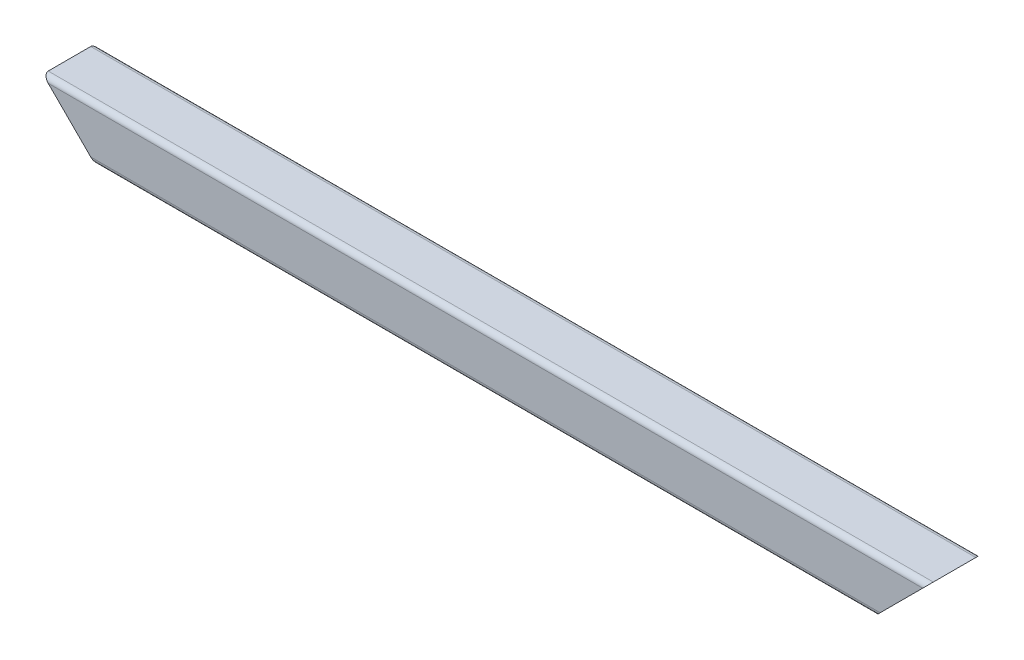
ISO-10303-21;
HEADER;
FILE_DESCRIPTION(('STEP AP214'),'2;1');
FILE_NAME('part.step','',(''),(''),'','','');
FILE_SCHEMA(('AUTOMOTIVE_DESIGN { 1 0 10303 214 1 1 1 1 }'));
ENDSEC;
DATA;
#1=APPLICATION_CONTEXT('core data for automotive mechanical design processes');
#2=APPLICATION_PROTOCOL_DEFINITION('international standard','automotive_design',2000,#1);
#3=PRODUCT_CONTEXT('',#1,'mechanical');
#4=PRODUCT('Part','Part','',(#3));
#5=PRODUCT_RELATED_PRODUCT_CATEGORY('part','',(#4));
#6=PRODUCT_DEFINITION_FORMATION('','',#4);
#7=PRODUCT_DEFINITION_CONTEXT('part definition',#1,'design');
#8=PRODUCT_DEFINITION('design','',#6,#7);
#9=PRODUCT_DEFINITION_SHAPE('','',#8);
#10=(LENGTH_UNIT() NAMED_UNIT(*) SI_UNIT(.MILLI.,.METRE.));
#11=(NAMED_UNIT(*) PLANE_ANGLE_UNIT() SI_UNIT($,.RADIAN.));
#12=(NAMED_UNIT(*) SI_UNIT($,.STERADIAN.) SOLID_ANGLE_UNIT());
#13=UNCERTAINTY_MEASURE_WITH_UNIT(LENGTH_MEASURE(1.E-05),#10,'distance_accuracy_value','');
#14=(GEOMETRIC_REPRESENTATION_CONTEXT(3) GLOBAL_UNCERTAINTY_ASSIGNED_CONTEXT((#13)) GLOBAL_UNIT_ASSIGNED_CONTEXT((#10,
#11,#12)) REPRESENTATION_CONTEXT('',''));
#15=CARTESIAN_POINT('',(0.,0.,0.));
#16=DIRECTION('',(0.,0.,1.));
#17=DIRECTION('',(1.,0.,0.));
#18=AXIS2_PLACEMENT_3D('',#15,#16,#17);
#19=CARTESIAN_POINT('',(125.,893.,-72.4999999999944));
#20=DIRECTION('',(-1.,0.,0.));
#21=DIRECTION('',(0.,0.,1.));
#22=AXIS2_PLACEMENT_3D('',#19,#20,#21);
#23=CYLINDRICAL_SURFACE('',#22,3.);
#24=CARTESIAN_POINT('',(223.,893.,-72.4999999999863));
#25=DIRECTION('',(0.707106781186547,-0.707106781186548,0.));
#26=DIRECTION('',(-0.707106781186548,-0.707106781186547,0.));
#27=AXIS2_PLACEMENT_3D('',#24,#25,#26);
#28=ELLIPSE('',#27,4.24264068711929,3.);
#29=CARTESIAN_POINT('',(223.,893.,-69.4999999999858));
#30=VERTEX_POINT('',#29);
#31=CARTESIAN_POINT('',(220.,890.,-72.4999999999865));
#32=VERTEX_POINT('',#31);
#33=EDGE_CURVE('E20',#30,#32,#28,.T.);
#34=ORIENTED_EDGE('',*,*,#33,.F.);
#35=DIRECTION('',(1.,0.,0.));
#36=VECTOR('',#35,1.);
#37=CARTESIAN_POINT('',(1.05345683867447E-13,893.,-69.5000000000048));
#38=LINE('',#37,#36);
#39=CARTESIAN_POINT('',(-222.999999999999,893.,-69.5000000000232));
#40=VERTEX_POINT('',#39);
#41=EDGE_CURVE('E111',#40,#30,#38,.T.);
#42=ORIENTED_EDGE('',*,*,#41,.F.);
#43=CARTESIAN_POINT('',(-222.999999999999,893.,-72.5000000000232));
#44=DIRECTION('',(-0.707106781186547,-0.707106781186548,0.));
#45=DIRECTION('',(-0.707106781186548,0.707106781186547,0.));
#46=AXIS2_PLACEMENT_3D('',#43,#44,#45);
#47=ELLIPSE('',#46,4.24264068711929,3.);
#48=CARTESIAN_POINT('',(-219.999999999998,890.,-72.5000000000048));
#49=VERTEX_POINT('',#48);
#50=EDGE_CURVE('E82',#49,#40,#47,.T.);
#51=ORIENTED_EDGE('',*,*,#50,.F.);
#52=DIRECTION('',(1.,0.,0.));
#53=VECTOR('',#52,1.);
#54=CARTESIAN_POINT('',(250.,890.,-72.4999999999865));
#55=LINE('',#54,#53);
#56=EDGE_CURVE('E79',#32,#49,#55,.F.);
#57=ORIENTED_EDGE('',*,*,#56,.F.);
#58=EDGE_LOOP('',(#34,#42,#51,#57));
#59=FACE_BOUND('',#58,.T.);
#60=ADVANCED_FACE('F17',(#59),#23,.T.);
#61=CARTESIAN_POINT('',(1.05345683867447E-13,440.,-69.5000000000048));
#62=DIRECTION('',(0.,0.,1.));
#63=DIRECTION('',(1.,0.,0.));
#64=AXIS2_PLACEMENT_3D('',#61,#62,#63);
#65=PLANE('',#64);
#66=DIRECTION('',(-1.,0.,0.));
#67=VECTOR('',#66,1.);
#68=CARTESIAN_POINT('',(-139.999999999999,917.,-69.5000000000163));
#69=LINE('',#68,#67);
#70=CARTESIAN_POINT('',(-246.999999999999,917.,-69.5000000000247));
#71=VERTEX_POINT('',#70);
#72=CARTESIAN_POINT('',(247.,917.,-69.4999999999843));
#73=VERTEX_POINT('',#72);
#74=EDGE_CURVE('E103',#71,#73,#69,.F.);
#75=ORIENTED_EDGE('',*,*,#74,.F.);
#76=DIRECTION('',(0.707106781186548,-0.707106781186547,0.));
#77=VECTOR('',#76,1.);
#78=CARTESIAN_POINT('',(-219.999999999999,890.,-69.5000000000232));
#79=LINE('',#78,#77);
#80=EDGE_CURVE('E122',#40,#71,#79,.F.);
#81=ORIENTED_EDGE('',*,*,#80,.F.);
#82=ORIENTED_EDGE('',*,*,#41,.T.);
#83=DIRECTION('',(0.707106781186548,0.707106781186547,0.));
#84=VECTOR('',#83,1.);
#85=CARTESIAN_POINT('',(250.,920.,-69.4999999999843));
#86=LINE('',#85,#84);
#87=EDGE_CURVE('E102',#73,#30,#86,.F.);
#88=ORIENTED_EDGE('',*,*,#87,.F.);
#89=EDGE_LOOP('',(#75,#81,#82,#88));
#90=FACE_BOUND('',#89,.T.);
#91=ADVANCED_FACE('F163',(#90),#65,.T.);
#92=CARTESIAN_POINT('',(2.57682764015499E-12,440.,-99.5000000000048));
#93=DIRECTION('',(0.,0.,-1.));
#94=DIRECTION('',(-1.,0.,0.));
#95=AXIS2_PLACEMENT_3D('',#92,#93,#94);
#96=PLANE('',#95);
#97=DIRECTION('',(-1.,0.,0.));
#98=VECTOR('',#97,1.);
#99=CARTESIAN_POINT('',(125.000000000002,893.,-99.4999999999944));
#100=LINE('',#99,#98);
#101=CARTESIAN_POINT('',(-222.999999999997,893.,-99.5000000000237));
#102=VERTEX_POINT('',#101);
#103=CARTESIAN_POINT('',(223.000000000002,893.,-99.4999999999863));
#104=VERTEX_POINT('',#103);
#105=EDGE_CURVE('E87',#102,#104,#100,.F.);
#106=ORIENTED_EDGE('',*,*,#105,.F.);
#107=DIRECTION('',(0.707106781186548,-0.707106781186547,0.));
#108=VECTOR('',#107,1.);
#109=CARTESIAN_POINT('',(-219.999999999998,890.000000000001,-99.5000000000252));
#110=LINE('',#109,#108);
#111=CARTESIAN_POINT('',(-246.999999999997,917.,-99.5000000000253));
#112=VERTEX_POINT('',#111);
#113=EDGE_CURVE('E117',#112,#102,#110,.T.);
#114=ORIENTED_EDGE('',*,*,#113,.F.);
#115=DIRECTION('',(1.,0.,0.));
#116=VECTOR('',#115,1.);
#117=CARTESIAN_POINT('',(-139.999999999997,917.,-99.5000000000164));
#118=LINE('',#117,#116);
#119=CARTESIAN_POINT('',(247.000000000002,917.,-99.4999999999848));
#120=VERTEX_POINT('',#119);
#121=EDGE_CURVE('E124',#120,#112,#118,.F.);
#122=ORIENTED_EDGE('',*,*,#121,.F.);
#123=DIRECTION('',(0.707106781186548,0.707106781186547,0.));
#124=VECTOR('',#123,1.);
#125=CARTESIAN_POINT('',(250.000000000001,919.999999999999,-99.4999999999863));
#126=LINE('',#125,#124);
#127=EDGE_CURVE('E129',#104,#120,#126,.T.);
#128=ORIENTED_EDGE('',*,*,#127,.F.);
#129=EDGE_LOOP('',(#106,#114,#122,#128));
#130=FACE_BOUND('',#129,.T.);
#131=ADVANCED_FACE('F154',(#130),#96,.T.);
#132=CARTESIAN_POINT('',(125.000000000002,893.,-96.4999999999944));
#133=DIRECTION('',(-1.,0.,0.));
#134=DIRECTION('',(0.,0.,1.));
#135=AXIS2_PLACEMENT_3D('',#132,#133,#134);
#136=CYLINDRICAL_SURFACE('',#135,3.);
#137=CARTESIAN_POINT('',(223.000000000002,893.,-96.4999999999863));
#138=DIRECTION('',(0.707106781186547,-0.707106781186548,0.));
#139=DIRECTION('',(-0.707106781186548,-0.707106781186547,0.));
#140=AXIS2_PLACEMENT_3D('',#137,#138,#139);
#141=ELLIPSE('',#140,4.24264068711928,3.);
#142=CARTESIAN_POINT('',(220.000000000002,890.,-96.5000000000047));
#143=VERTEX_POINT('',#142);
#144=EDGE_CURVE('E96',#143,#104,#141,.T.);
#145=ORIENTED_EDGE('',*,*,#144,.F.);
#146=DIRECTION('',(1.,0.,0.));
#147=VECTOR('',#146,1.);
#148=CARTESIAN_POINT('',(250.,890.,-96.500000000023));
#149=LINE('',#148,#147);
#150=CARTESIAN_POINT('',(-219.999999999997,890.,-96.500000000023));
#151=VERTEX_POINT('',#150);
#152=EDGE_CURVE('E86',#151,#143,#149,.T.);
#153=ORIENTED_EDGE('',*,*,#152,.F.);
#154=CARTESIAN_POINT('',(-222.999999999997,893.,-96.5000000000233));
#155=DIRECTION('',(-0.707106781186547,-0.707106781186548,0.));
#156=DIRECTION('',(-0.707106781186548,0.707106781186547,0.));
#157=AXIS2_PLACEMENT_3D('',#154,#155,#156);
#158=ELLIPSE('',#157,4.24264068711928,3.);
#159=EDGE_CURVE('E113',#102,#151,#158,.T.);
#160=ORIENTED_EDGE('',*,*,#159,.F.);
#161=ORIENTED_EDGE('',*,*,#105,.T.);
#162=EDGE_LOOP('',(#145,#153,#160,#161));
#163=FACE_BOUND('',#162,.T.);
#164=ADVANCED_FACE('F155',(#163),#136,.T.);
#165=CARTESIAN_POINT('',(250.,890.,-69.4999999999841));
#166=DIRECTION('',(0.,-1.,0.));
#167=DIRECTION('',(0.,0.,-1.));
#168=AXIS2_PLACEMENT_3D('',#165,#166,#167);
#169=PLANE('',#168);
#170=ORIENTED_EDGE('',*,*,#152,.T.);
#171=DIRECTION('',(0.,0.,1.));
#172=VECTOR('',#171,1.);
#173=CARTESIAN_POINT('',(220.,890.,-69.4999999999841));
#174=LINE('',#173,#172);
#175=EDGE_CURVE('E90',#32,#143,#174,.F.);
#176=ORIENTED_EDGE('',*,*,#175,.F.);
#177=ORIENTED_EDGE('',*,*,#56,.T.);
#178=DIRECTION('',(0.,0.,1.));
#179=VECTOR('',#178,1.);
#180=CARTESIAN_POINT('',(-219.999999999998,889.999999999999,-69.500000000023));
#181=LINE('',#180,#179);
#182=EDGE_CURVE('E116',#151,#49,#181,.T.);
#183=ORIENTED_EDGE('',*,*,#182,.F.);
#184=EDGE_LOOP('',(#170,#176,#177,#183));
#185=FACE_BOUND('',#184,.T.);
#186=ADVANCED_FACE('F91',(#185),#169,.T.);
#187=CARTESIAN_POINT('',(-139.999999999999,917.,-72.5000000000163));
#188=DIRECTION('',(-1.,0.,0.));
#189=DIRECTION('',(0.,0.,1.));
#190=AXIS2_PLACEMENT_3D('',#187,#188,#189);
#191=CYLINDRICAL_SURFACE('',#190,3.);
#192=CARTESIAN_POINT('',(247.,917.,-72.4999999999843));
#193=DIRECTION('',(0.707106781186547,-0.707106781186548,0.));
#194=DIRECTION('',(-0.707106781186548,-0.707106781186547,0.));
#195=AXIS2_PLACEMENT_3D('',#192,#193,#194);
#196=ELLIPSE('',#195,4.24264068711929,3.);
#197=CARTESIAN_POINT('',(250.,920.,-72.5000000000048));
#198=VERTEX_POINT('',#197);
#199=EDGE_CURVE('E128',#198,#73,#196,.T.);
#200=ORIENTED_EDGE('',*,*,#199,.F.);
#201=DIRECTION('',(1.,0.,0.));
#202=VECTOR('',#201,1.);
#203=CARTESIAN_POINT('',(-279.999999999999,920.,-72.5000000000254));
#204=LINE('',#203,#202);
#205=CARTESIAN_POINT('',(-249.999999999998,920.,-72.5000000000254));
#206=VERTEX_POINT('',#205);
#207=EDGE_CURVE('E137',#206,#198,#204,.T.);
#208=ORIENTED_EDGE('',*,*,#207,.F.);
#209=CARTESIAN_POINT('',(-246.999999999999,917.,-72.5000000000252));
#210=DIRECTION('',(-0.707106781186547,-0.707106781186548,0.));
#211=DIRECTION('',(-0.707106781186548,0.707106781186547,0.));
#212=AXIS2_PLACEMENT_3D('',#209,#210,#211);
#213=ELLIPSE('',#212,4.24264068711929,3.);
#214=EDGE_CURVE('E119',#71,#206,#213,.T.);
#215=ORIENTED_EDGE('',*,*,#214,.F.);
#216=ORIENTED_EDGE('',*,*,#74,.T.);
#217=EDGE_LOOP('',(#200,#208,#215,#216));
#218=FACE_BOUND('',#217,.T.);
#219=ADVANCED_FACE('F160',(#218),#191,.T.);
#220=CARTESIAN_POINT('',(250.,920.,-69.4999999999841));
#221=DIRECTION('',(0.707106781186547,-0.707106781186548,0.));
#222=DIRECTION('',(0.707106781186548,0.707106781186547,0.));
#223=AXIS2_PLACEMENT_3D('',#220,#221,#222);
#224=PLANE('',#223);
#225=ORIENTED_EDGE('',*,*,#199,.T.);
#226=ORIENTED_EDGE('',*,*,#87,.T.);
#227=ORIENTED_EDGE('',*,*,#33,.T.);
#228=ORIENTED_EDGE('',*,*,#175,.T.);
#229=ORIENTED_EDGE('',*,*,#144,.T.);
#230=ORIENTED_EDGE('',*,*,#127,.T.);
#231=CARTESIAN_POINT('',(247.000000000002,917.,-96.4999999999843));
#232=DIRECTION('',(0.707106781186547,-0.707106781186548,0.));
#233=DIRECTION('',(0.707106781186548,0.707106781186547,0.));
#234=AXIS2_PLACEMENT_3D('',#231,#232,#233);
#235=ELLIPSE('',#234,4.24264068711929,3.);
#236=CARTESIAN_POINT('',(250.000000000001,920.,-96.4999999999841));
#237=VERTEX_POINT('',#236);
#238=EDGE_CURVE('E125',#237,#120,#235,.F.);
#239=ORIENTED_EDGE('',*,*,#238,.F.);
#240=DIRECTION('',(0.,0.,1.));
#241=VECTOR('',#240,1.);
#242=CARTESIAN_POINT('',(250.,920.,-69.5000000000279));
#243=LINE('',#242,#241);
#244=EDGE_CURVE('E134',#198,#237,#243,.F.);
#245=ORIENTED_EDGE('',*,*,#244,.F.);
#246=EDGE_LOOP('',(#225,#226,#227,#228,#229,#230,#239,#245));
#247=FACE_BOUND('',#246,.T.);
#248=ADVANCED_FACE('F100',(#247),#224,.T.);
#249=CARTESIAN_POINT('',(-139.999999999997,917.,-96.5000000000164));
#250=DIRECTION('',(1.,0.,0.));
#251=DIRECTION('',(0.,0.,-1.));
#252=AXIS2_PLACEMENT_3D('',#249,#250,#251);
#253=CYLINDRICAL_SURFACE('',#252,3.);
#254=CARTESIAN_POINT('',(-246.999999999997,917.,-96.5000000000253));
#255=DIRECTION('',(-0.707106781186547,-0.707106781186548,0.));
#256=DIRECTION('',(0.707106781186548,-0.707106781186547,0.));
#257=AXIS2_PLACEMENT_3D('',#254,#255,#256);
#258=ELLIPSE('',#257,4.24264068711929,3.);
#259=CARTESIAN_POINT('',(-249.999999999997,920.,-96.5000000000047));
#260=VERTEX_POINT('',#259);
#261=EDGE_CURVE('E35',#260,#112,#258,.T.);
#262=ORIENTED_EDGE('',*,*,#261,.F.);
#263=DIRECTION('',(1.,0.,0.));
#264=VECTOR('',#263,1.);
#265=CARTESIAN_POINT('',(-279.999999999999,920.,-96.4999999999841));
#266=LINE('',#265,#264);
#267=EDGE_CURVE('E26',#237,#260,#266,.F.);
#268=ORIENTED_EDGE('',*,*,#267,.F.);
#269=ORIENTED_EDGE('',*,*,#238,.T.);
#270=ORIENTED_EDGE('',*,*,#121,.T.);
#271=EDGE_LOOP('',(#262,#268,#269,#270));
#272=FACE_BOUND('',#271,.T.);
#273=ADVANCED_FACE('F159',(#272),#253,.T.);
#274=CARTESIAN_POINT('',(-219.999999999999,890.,-69.500000000023));
#275=DIRECTION('',(-0.707106781186547,-0.707106781186548,0.));
#276=DIRECTION('',(0.707106781186548,-0.707106781186547,0.));
#277=AXIS2_PLACEMENT_3D('',#274,#275,#276);
#278=PLANE('',#277);
#279=ORIENTED_EDGE('',*,*,#159,.T.);
#280=ORIENTED_EDGE('',*,*,#182,.T.);
#281=ORIENTED_EDGE('',*,*,#50,.T.);
#282=ORIENTED_EDGE('',*,*,#80,.T.);
#283=ORIENTED_EDGE('',*,*,#214,.T.);
#284=DIRECTION('',(0.,0.,1.));
#285=VECTOR('',#284,1.);
#286=CARTESIAN_POINT('',(-249.999999999997,920.,-69.5000000000279));
#287=LINE('',#286,#285);
#288=EDGE_CURVE('E11',#260,#206,#287,.T.);
#289=ORIENTED_EDGE('',*,*,#288,.F.);
#290=ORIENTED_EDGE('',*,*,#261,.T.);
#291=ORIENTED_EDGE('',*,*,#113,.T.);
#292=EDGE_LOOP('',(#279,#280,#281,#282,#283,#289,#290,#291));
#293=FACE_BOUND('',#292,.T.);
#294=ADVANCED_FACE('F148',(#293),#278,.T.);
#295=CARTESIAN_POINT('',(-279.999999999999,920.,-69.5000000000279));
#296=DIRECTION('',(0.,1.,0.));
#297=DIRECTION('',(0.,0.,1.));
#298=AXIS2_PLACEMENT_3D('',#295,#296,#297);
#299=PLANE('',#298);
#300=ORIENTED_EDGE('',*,*,#267,.T.);
#301=ORIENTED_EDGE('',*,*,#288,.T.);
#302=ORIENTED_EDGE('',*,*,#207,.T.);
#303=ORIENTED_EDGE('',*,*,#244,.T.);
#304=EDGE_LOOP('',(#300,#301,#302,#303));
#305=FACE_BOUND('',#304,.T.);
#306=ADVANCED_FACE('F157',(#305),#299,.T.);
#307=CLOSED_SHELL('',(#60,#91,#131,#164,#186,#219,#248,#273,#294,#306));
#308=MANIFOLD_SOLID_BREP('B1',#307);
#309=ADVANCED_BREP_SHAPE_REPRESENTATION('',(#18,#308),#14);
#310=SHAPE_DEFINITION_REPRESENTATION(#9,#309);
ENDSEC;
END-ISO-10303-21;
